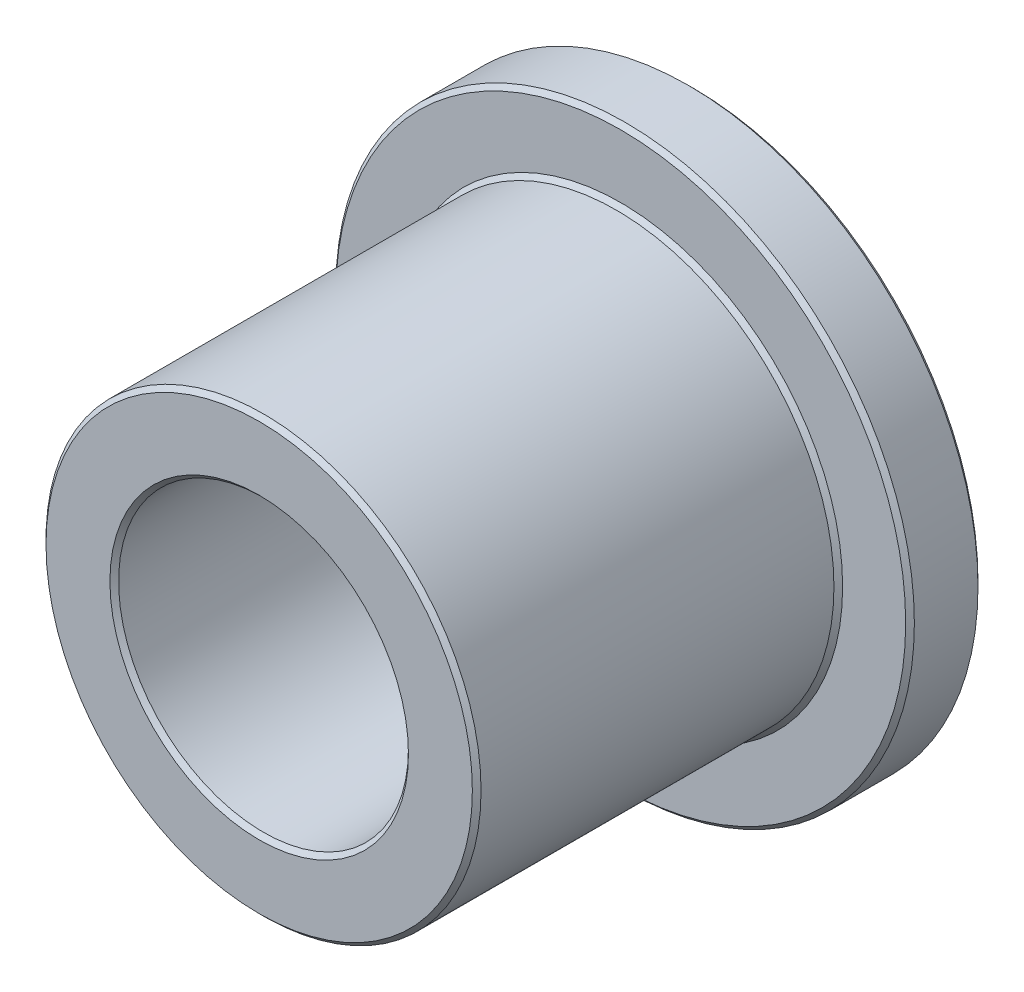
ISO-10303-21;
HEADER;
FILE_DESCRIPTION(('STEP AP214'),'2;1');
FILE_NAME('part.step','',(''),(''),'','','');
FILE_SCHEMA(('AUTOMOTIVE_DESIGN { 1 0 10303 214 1 1 1 1 }'));
ENDSEC;
DATA;
#1=APPLICATION_CONTEXT('core data for automotive mechanical design processes');
#2=APPLICATION_PROTOCOL_DEFINITION('international standard','automotive_design',2000,#1);
#3=PRODUCT_CONTEXT('',#1,'mechanical');
#4=PRODUCT('Part','Part','',(#3));
#5=PRODUCT_RELATED_PRODUCT_CATEGORY('part','',(#4));
#6=PRODUCT_DEFINITION_FORMATION('','',#4);
#7=PRODUCT_DEFINITION_CONTEXT('part definition',#1,'design');
#8=PRODUCT_DEFINITION('design','',#6,#7);
#9=PRODUCT_DEFINITION_SHAPE('','',#8);
#10=(LENGTH_UNIT() NAMED_UNIT(*) SI_UNIT(.MILLI.,.METRE.));
#11=(NAMED_UNIT(*) PLANE_ANGLE_UNIT() SI_UNIT($,.RADIAN.));
#12=(NAMED_UNIT(*) SI_UNIT($,.STERADIAN.) SOLID_ANGLE_UNIT());
#13=UNCERTAINTY_MEASURE_WITH_UNIT(LENGTH_MEASURE(1.E-05),#10,'distance_accuracy_value','');
#14=(GEOMETRIC_REPRESENTATION_CONTEXT(3) GLOBAL_UNCERTAINTY_ASSIGNED_CONTEXT((#13)) GLOBAL_UNIT_ASSIGNED_CONTEXT((#10,
#11,#12)) REPRESENTATION_CONTEXT('',''));
#15=CARTESIAN_POINT('',(0.,0.,0.));
#16=DIRECTION('',(0.,0.,1.));
#17=DIRECTION('',(1.,0.,0.));
#18=AXIS2_PLACEMENT_3D('',#15,#16,#17);
#19=CARTESIAN_POINT('',(0.,0.,-6.35));
#20=DIRECTION('',(0.,0.,-1.));
#21=DIRECTION('',(1.,0.,0.));
#22=AXIS2_PLACEMENT_3D('',#19,#20,#21);
#23=CYLINDRICAL_SURFACE('',#22,12.7);
#24=CARTESIAN_POINT('',(0.,0.,-9.33411899999999));
#25=DIRECTION('',(0.,0.,1.));
#26=DIRECTION('',(1.,0.,0.));
#27=AXIS2_PLACEMENT_3D('',#24,#25,#26);
#28=CIRCLE('',#27,12.7);
#29=CARTESIAN_POINT('',(12.7,0.,-9.33411899999999));
#30=VERTEX_POINT('',#29);
#31=EDGE_CURVE('E59',#30,#30,#28,.F.);
#32=ORIENTED_EDGE('',*,*,#31,.F.);
#33=EDGE_LOOP('',(#32));
#34=FACE_BOUND('',#33,.T.);
#35=CARTESIAN_POINT('',(0.,0.,-6.540881));
#36=DIRECTION('',(0.,0.,1.));
#37=DIRECTION('',(1.,0.,0.));
#38=AXIS2_PLACEMENT_3D('',#35,#36,#37);
#39=CIRCLE('',#38,12.7);
#40=CARTESIAN_POINT('',(12.7,0.,-6.540881));
#41=VERTEX_POINT('',#40);
#42=EDGE_CURVE('E62',#41,#41,#39,.T.);
#43=ORIENTED_EDGE('',*,*,#42,.F.);
#44=EDGE_LOOP('',(#43));
#45=FACE_BOUND('',#44,.T.);
#46=ADVANCED_FACE('F33',(#34,#45),#23,.T.);
#47=CARTESIAN_POINT('',(0.,0.,-6.35));
#48=DIRECTION('',(0.,0.,-1.));
#49=DIRECTION('',(1.,0.,0.));
#50=AXIS2_PLACEMENT_3D('',#47,#48,#49);
#51=PLANE('',#50);
#52=CARTESIAN_POINT('',(0.,0.,-6.35));
#53=DIRECTION('',(0.,0.,1.));
#54=DIRECTION('',(1.,0.,0.));
#55=AXIS2_PLACEMENT_3D('',#52,#53,#54);
#56=CIRCLE('',#55,12.509119);
#57=CARTESIAN_POINT('',(12.509119,0.,-6.35));
#58=VERTEX_POINT('',#57);
#59=EDGE_CURVE('E53',#58,#58,#56,.F.);
#60=ORIENTED_EDGE('',*,*,#59,.F.);
#61=EDGE_LOOP('',(#60));
#62=FACE_BOUND('',#61,.T.);
#63=CARTESIAN_POINT('',(0.,0.,-6.35));
#64=DIRECTION('',(0.,0.,1.));
#65=DIRECTION('',(1.,0.,0.));
#66=AXIS2_PLACEMENT_3D('',#63,#64,#65);
#67=CIRCLE('',#66,9.741281);
#68=CARTESIAN_POINT('',(9.741281,0.,-6.35));
#69=VERTEX_POINT('',#68);
#70=EDGE_CURVE('E56',#69,#69,#67,.T.);
#71=ORIENTED_EDGE('',*,*,#70,.F.);
#72=EDGE_LOOP('',(#71));
#73=FACE_BOUND('',#72,.T.);
#74=ADVANCED_FACE('F93',(#62,#73),#51,.F.);
#75=CARTESIAN_POINT('',(0.,0.,-9.525));
#76=DIRECTION('',(0.,0.,-1.));
#77=DIRECTION('',(1.,0.,0.));
#78=AXIS2_PLACEMENT_3D('',#75,#76,#77);
#79=PLANE('',#78);
#80=CARTESIAN_POINT('',(0.,0.,-9.525));
#81=DIRECTION('',(0.,0.,1.));
#82=DIRECTION('',(1.,0.,0.));
#83=AXIS2_PLACEMENT_3D('',#80,#81,#82);
#84=CIRCLE('',#83,6.553581);
#85=CARTESIAN_POINT('',(6.553581,0.,-9.525));
#86=VERTEX_POINT('',#85);
#87=EDGE_CURVE('E65',#86,#86,#84,.F.);
#88=ORIENTED_EDGE('',*,*,#87,.F.);
#89=EDGE_LOOP('',(#88));
#90=FACE_BOUND('',#89,.T.);
#91=CARTESIAN_POINT('',(0.,0.,-9.525));
#92=DIRECTION('',(0.,0.,1.));
#93=DIRECTION('',(1.,0.,0.));
#94=AXIS2_PLACEMENT_3D('',#91,#92,#93);
#95=CIRCLE('',#94,12.509119);
#96=CARTESIAN_POINT('',(12.509119,0.,-9.525));
#97=VERTEX_POINT('',#96);
#98=EDGE_CURVE('E68',#97,#97,#95,.T.);
#99=ORIENTED_EDGE('',*,*,#98,.F.);
#100=EDGE_LOOP('',(#99));
#101=FACE_BOUND('',#100,.T.);
#102=ADVANCED_FACE('F83',(#90,#101),#79,.T.);
#103=CARTESIAN_POINT('',(0.,0.,-6.35));
#104=DIRECTION('',(0.,0.,-1.));
#105=DIRECTION('',(1.,0.,0.));
#106=AXIS2_PLACEMENT_3D('',#103,#104,#105);
#107=CYLINDRICAL_SURFACE('',#106,6.3627);
#108=CARTESIAN_POINT('',(0.,0.,-9.33411899999999));
#109=DIRECTION('',(0.,0.,1.));
#110=DIRECTION('',(1.,0.,0.));
#111=AXIS2_PLACEMENT_3D('',#108,#109,#110);
#112=CIRCLE('',#111,6.3627);
#113=CARTESIAN_POINT('',(6.3627,0.,-9.33411899999999));
#114=VERTEX_POINT('',#113);
#115=EDGE_CURVE('E71',#114,#114,#112,.T.);
#116=ORIENTED_EDGE('',*,*,#115,.F.);
#117=EDGE_LOOP('',(#116));
#118=FACE_BOUND('',#117,.T.);
#119=CARTESIAN_POINT('',(0.,0.,9.334119));
#120=DIRECTION('',(0.,0.,1.));
#121=DIRECTION('',(1.,0.,0.));
#122=AXIS2_PLACEMENT_3D('',#119,#120,#121);
#123=CIRCLE('',#122,6.3627);
#124=CARTESIAN_POINT('',(6.3627,0.,9.334119));
#125=VERTEX_POINT('',#124);
#126=EDGE_CURVE('E74',#125,#125,#123,.F.);
#127=ORIENTED_EDGE('',*,*,#126,.F.);
#128=EDGE_LOOP('',(#127));
#129=FACE_BOUND('',#128,.T.);
#130=ADVANCED_FACE('F80',(#118,#129),#107,.F.);
#131=CARTESIAN_POINT('',(0.,0.,9.525));
#132=DIRECTION('',(0.,0.,-1.));
#133=DIRECTION('',(1.,0.,0.));
#134=AXIS2_PLACEMENT_3D('',#131,#132,#133);
#135=CYLINDRICAL_SURFACE('',#134,9.5504);
#136=CARTESIAN_POINT('',(0.,0.,-6.15911899999999));
#137=DIRECTION('',(0.,0.,1.));
#138=DIRECTION('',(1.,0.,0.));
#139=AXIS2_PLACEMENT_3D('',#136,#137,#138);
#140=CIRCLE('',#139,9.5504);
#141=CARTESIAN_POINT('',(9.5504,0.,-6.15911899999999));
#142=VERTEX_POINT('',#141);
#143=EDGE_CURVE('E44',#142,#142,#140,.F.);
#144=ORIENTED_EDGE('',*,*,#143,.F.);
#145=EDGE_LOOP('',(#144));
#146=FACE_BOUND('',#145,.T.);
#147=CARTESIAN_POINT('',(0.,0.,9.334119));
#148=DIRECTION('',(0.,0.,1.));
#149=DIRECTION('',(1.,0.,0.));
#150=AXIS2_PLACEMENT_3D('',#147,#148,#149);
#151=CIRCLE('',#150,9.5504);
#152=CARTESIAN_POINT('',(9.5504,0.,9.334119));
#153=VERTEX_POINT('',#152);
#154=EDGE_CURVE('E48',#153,#153,#151,.T.);
#155=ORIENTED_EDGE('',*,*,#154,.F.);
#156=EDGE_LOOP('',(#155));
#157=FACE_BOUND('',#156,.T.);
#158=ADVANCED_FACE('F82',(#146,#157),#135,.T.);
#159=CARTESIAN_POINT('',(0.,0.,9.525));
#160=DIRECTION('',(0.,0.,-1.));
#161=DIRECTION('',(1.,0.,0.));
#162=AXIS2_PLACEMENT_3D('',#159,#160,#161);
#163=PLANE('',#162);
#164=CARTESIAN_POINT('',(0.,0.,9.525));
#165=DIRECTION('',(0.,0.,1.));
#166=DIRECTION('',(1.,0.,0.));
#167=AXIS2_PLACEMENT_3D('',#164,#165,#166);
#168=CIRCLE('',#167,6.553581);
#169=CARTESIAN_POINT('',(6.553581,0.,9.525));
#170=VERTEX_POINT('',#169);
#171=EDGE_CURVE('E10',#170,#170,#168,.T.);
#172=ORIENTED_EDGE('',*,*,#171,.F.);
#173=EDGE_LOOP('',(#172));
#174=FACE_BOUND('',#173,.T.);
#175=CARTESIAN_POINT('',(0.,0.,9.525));
#176=DIRECTION('',(0.,0.,1.));
#177=DIRECTION('',(1.,0.,0.));
#178=AXIS2_PLACEMENT_3D('',#175,#176,#177);
#179=CIRCLE('',#178,9.35951900000001);
#180=CARTESIAN_POINT('',(9.35951900000001,0.,9.525));
#181=VERTEX_POINT('',#180);
#182=EDGE_CURVE('E40',#181,#181,#179,.F.);
#183=ORIENTED_EDGE('',*,*,#182,.F.);
#184=EDGE_LOOP('',(#183));
#185=FACE_BOUND('',#184,.T.);
#186=ADVANCED_FACE('F90',(#174,#185),#163,.F.);
#187=CARTESIAN_POINT('',(0.,0.,-9.33411899999999));
#188=DIRECTION('',(0.,0.,-1.));
#189=DIRECTION('',(1.,0.,0.));
#190=AXIS2_PLACEMENT_3D('',#187,#188,#189);
#191=CONICAL_SURFACE('',#190,6.3627,0.785398163397451);
#192=ORIENTED_EDGE('',*,*,#87,.T.);
#193=EDGE_LOOP('',(#192));
#194=FACE_BOUND('',#193,.T.);
#195=ORIENTED_EDGE('',*,*,#115,.T.);
#196=EDGE_LOOP('',(#195));
#197=FACE_BOUND('',#196,.T.);
#198=ADVANCED_FACE('F108',(#194,#197),#191,.F.);
#199=CARTESIAN_POINT('',(0.,0.,-9.525));
#200=DIRECTION('',(0.,0.,1.));
#201=DIRECTION('',(-1.,0.,0.));
#202=AXIS2_PLACEMENT_3D('',#199,#200,#201);
#203=CONICAL_SURFACE('',#202,12.509119,0.785398163397462);
#204=ORIENTED_EDGE('',*,*,#31,.T.);
#205=EDGE_LOOP('',(#204));
#206=FACE_BOUND('',#205,.T.);
#207=ORIENTED_EDGE('',*,*,#98,.T.);
#208=EDGE_LOOP('',(#207));
#209=FACE_BOUND('',#208,.T.);
#210=ADVANCED_FACE('F111',(#206,#209),#203,.T.);
#211=CARTESIAN_POINT('',(0.,0.,-6.540881));
#212=DIRECTION('',(0.,0.,-1.));
#213=DIRECTION('',(1.,0.,0.));
#214=AXIS2_PLACEMENT_3D('',#211,#212,#213);
#215=CONICAL_SURFACE('',#214,12.7,0.785398163397444);
#216=ORIENTED_EDGE('',*,*,#59,.T.);
#217=EDGE_LOOP('',(#216));
#218=FACE_BOUND('',#217,.T.);
#219=ORIENTED_EDGE('',*,*,#42,.T.);
#220=EDGE_LOOP('',(#219));
#221=FACE_BOUND('',#220,.T.);
#222=ADVANCED_FACE('F115',(#218,#221),#215,.T.);
#223=CARTESIAN_POINT('',(0.,0.,-6.35));
#224=DIRECTION('',(0.,0.,-1.));
#225=DIRECTION('',(1.,0.,0.));
#226=AXIS2_PLACEMENT_3D('',#223,#224,#225);
#227=CONICAL_SURFACE('',#226,9.741281,0.785398163397448);
#228=ORIENTED_EDGE('',*,*,#143,.T.);
#229=EDGE_LOOP('',(#228));
#230=FACE_BOUND('',#229,.T.);
#231=ORIENTED_EDGE('',*,*,#70,.T.);
#232=EDGE_LOOP('',(#231));
#233=FACE_BOUND('',#232,.T.);
#234=ADVANCED_FACE('F119',(#230,#233),#227,.T.);
#235=CARTESIAN_POINT('',(0.,0.,9.525));
#236=DIRECTION('',(0.,0.,1.));
#237=DIRECTION('',(-1.,0.,0.));
#238=AXIS2_PLACEMENT_3D('',#235,#236,#237);
#239=CONICAL_SURFACE('',#238,6.553581,0.785398163397446);
#240=ORIENTED_EDGE('',*,*,#126,.T.);
#241=EDGE_LOOP('',(#240));
#242=FACE_BOUND('',#241,.T.);
#243=ORIENTED_EDGE('',*,*,#171,.T.);
#244=EDGE_LOOP('',(#243));
#245=FACE_BOUND('',#244,.T.);
#246=ADVANCED_FACE('F78',(#242,#245),#239,.F.);
#247=CARTESIAN_POINT('',(0.,0.,9.334119));
#248=DIRECTION('',(0.,0.,-1.));
#249=DIRECTION('',(1.,0.,0.));
#250=AXIS2_PLACEMENT_3D('',#247,#248,#249);
#251=CONICAL_SURFACE('',#250,9.5504,0.785398163397435);
#252=ORIENTED_EDGE('',*,*,#182,.T.);
#253=EDGE_LOOP('',(#252));
#254=FACE_BOUND('',#253,.T.);
#255=ORIENTED_EDGE('',*,*,#154,.T.);
#256=EDGE_LOOP('',(#255));
#257=FACE_BOUND('',#256,.T.);
#258=ADVANCED_FACE('F35',(#254,#257),#251,.T.);
#259=CLOSED_SHELL('',(#46,#74,#102,#130,#158,#186,#198,#210,#222,#234,#246,#258));
#260=MANIFOLD_SOLID_BREP('B2',#259);
#261=ADVANCED_BREP_SHAPE_REPRESENTATION('',(#18,#260),#14);
#262=SHAPE_DEFINITION_REPRESENTATION(#9,#261);
ENDSEC;
END-ISO-10303-21;
